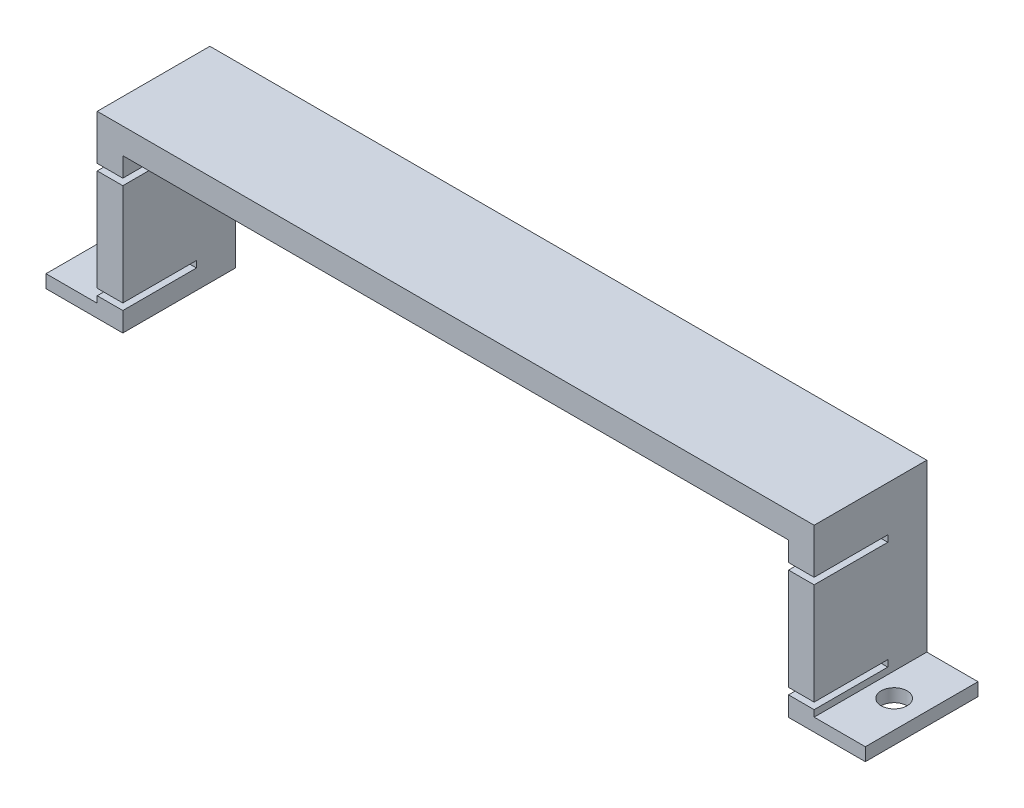
ISO-10303-21;
HEADER;
FILE_DESCRIPTION(('STEP AP214'),'2;1');
FILE_NAME('part.step','',(''),(''),'','','');
FILE_SCHEMA(('AUTOMOTIVE_DESIGN { 1 0 10303 214 1 1 1 1 }'));
ENDSEC;
DATA;
#1=APPLICATION_CONTEXT('core data for automotive mechanical design processes');
#2=APPLICATION_PROTOCOL_DEFINITION('international standard','automotive_design',2000,#1);
#3=PRODUCT_CONTEXT('',#1,'mechanical');
#4=PRODUCT('Part','Part','',(#3));
#5=PRODUCT_RELATED_PRODUCT_CATEGORY('part','',(#4));
#6=PRODUCT_DEFINITION_FORMATION('','',#4);
#7=PRODUCT_DEFINITION_CONTEXT('part definition',#1,'design');
#8=PRODUCT_DEFINITION('design','',#6,#7);
#9=PRODUCT_DEFINITION_SHAPE('','',#8);
#10=(LENGTH_UNIT() NAMED_UNIT(*) SI_UNIT(.MILLI.,.METRE.));
#11=(NAMED_UNIT(*) PLANE_ANGLE_UNIT() SI_UNIT($,.RADIAN.));
#12=(NAMED_UNIT(*) SI_UNIT($,.STERADIAN.) SOLID_ANGLE_UNIT());
#13=UNCERTAINTY_MEASURE_WITH_UNIT(LENGTH_MEASURE(1.E-05),#10,'distance_accuracy_value','');
#14=(GEOMETRIC_REPRESENTATION_CONTEXT(3) GLOBAL_UNCERTAINTY_ASSIGNED_CONTEXT((#13)) GLOBAL_UNIT_ASSIGNED_CONTEXT((#10,
#11,#12)) REPRESENTATION_CONTEXT('',''));
#15=CARTESIAN_POINT('',(0.,0.,0.));
#16=DIRECTION('',(0.,0.,1.));
#17=DIRECTION('',(1.,0.,0.));
#18=AXIS2_PLACEMENT_3D('',#15,#16,#17);
#19=CARTESIAN_POINT('',(0.,35.,0.));
#20=DIRECTION('',(0.,0.,-1.));
#21=DIRECTION('',(-1.,0.,0.));
#22=AXIS2_PLACEMENT_3D('',#19,#20,#21);
#23=PLANE('',#22);
#24=DIRECTION('',(0.,-1.,0.));
#25=VECTOR('',#24,1.);
#26=CARTESIAN_POINT('',(15.,0.,0.));
#27=LINE('',#26,#25);
#28=CARTESIAN_POINT('',(15.,3.81,0.));
#29=VERTEX_POINT('',#28);
#30=CARTESIAN_POINT('',(15.,0.,0.));
#31=VERTEX_POINT('',#30);
#32=EDGE_CURVE('E349',#29,#31,#27,.T.);
#33=ORIENTED_EDGE('',*,*,#32,.F.);
#34=DIRECTION('',(-1.,0.,0.));
#35=VECTOR('',#34,1.);
#36=CARTESIAN_POINT('',(160.,3.81000000000002,0.));
#37=LINE('',#36,#35);
#38=CARTESIAN_POINT('',(9.99999999999999,3.81,0.));
#39=VERTEX_POINT('',#38);
#40=EDGE_CURVE('E251',#29,#39,#37,.T.);
#41=ORIENTED_EDGE('',*,*,#40,.T.);
#42=DIRECTION('',(0.,1.,0.));
#43=VECTOR('',#42,1.);
#44=CARTESIAN_POINT('',(9.99999999999998,35.,0.));
#45=LINE('',#44,#43);
#46=CARTESIAN_POINT('',(9.99999999999999,2.54,0.));
#47=VERTEX_POINT('',#46);
#48=EDGE_CURVE('E335',#47,#39,#45,.T.);
#49=ORIENTED_EDGE('',*,*,#48,.F.);
#50=DIRECTION('',(1.,0.,0.));
#51=VECTOR('',#50,1.);
#52=CARTESIAN_POINT('',(0.,2.54,0.));
#53=LINE('',#52,#51);
#54=CARTESIAN_POINT('',(0.,2.54,0.));
#55=VERTEX_POINT('',#54);
#56=EDGE_CURVE('E339',#55,#47,#53,.T.);
#57=ORIENTED_EDGE('',*,*,#56,.F.);
#58=DIRECTION('',(0.,-1.,0.));
#59=VECTOR('',#58,1.);
#60=CARTESIAN_POINT('',(0.,35.,0.));
#61=LINE('',#60,#59);
#62=CARTESIAN_POINT('',(0.,0.,0.));
#63=VERTEX_POINT('',#62);
#64=EDGE_CURVE('E11',#55,#63,#61,.T.);
#65=ORIENTED_EDGE('',*,*,#64,.T.);
#66=DIRECTION('',(1.,0.,0.));
#67=VECTOR('',#66,1.);
#68=CARTESIAN_POINT('',(0.,0.,0.));
#69=LINE('',#68,#67);
#70=EDGE_CURVE('E415',#63,#31,#69,.T.);
#71=ORIENTED_EDGE('',*,*,#70,.T.);
#72=EDGE_LOOP('',(#33,#41,#49,#57,#65,#71));
#73=FACE_BOUND('',#72,.T.);
#74=ADVANCED_FACE('F37',(#73),#23,.F.);
#75=DIRECTION('',(0.,-1.,0.));
#76=VECTOR('',#75,1.);
#77=CARTESIAN_POINT('',(150.,35.,0.));
#78=LINE('',#77,#76);
#79=CARTESIAN_POINT('',(150.,3.81000000000002,0.));
#80=VERTEX_POINT('',#79);
#81=CARTESIAN_POINT('',(150.,2.54000000000002,0.));
#82=VERTEX_POINT('',#81);
#83=EDGE_CURVE('E330',#80,#82,#78,.T.);
#84=ORIENTED_EDGE('',*,*,#83,.F.);
#85=CARTESIAN_POINT('',(145.,3.81000000000001,0.));
#86=VERTEX_POINT('',#85);
#87=EDGE_CURVE('E254',#80,#86,#37,.T.);
#88=ORIENTED_EDGE('',*,*,#87,.T.);
#89=DIRECTION('',(0.,1.,0.));
#90=VECTOR('',#89,1.);
#91=CARTESIAN_POINT('',(145.,0.,0.));
#92=LINE('',#91,#90);
#93=CARTESIAN_POINT('',(145.,0.,0.));
#94=VERTEX_POINT('',#93);
#95=EDGE_CURVE('E388',#94,#86,#92,.T.);
#96=ORIENTED_EDGE('',*,*,#95,.F.);
#97=CARTESIAN_POINT('',(160.,0.,0.));
#98=VERTEX_POINT('',#97);
#99=EDGE_CURVE('E414',#94,#98,#69,.T.);
#100=ORIENTED_EDGE('',*,*,#99,.T.);
#101=DIRECTION('',(0.,-1.,0.));
#102=VECTOR('',#101,1.);
#103=CARTESIAN_POINT('',(160.,35.,0.));
#104=LINE('',#103,#102);
#105=CARTESIAN_POINT('',(160.,2.54000000000002,0.));
#106=VERTEX_POINT('',#105);
#107=EDGE_CURVE('E45',#106,#98,#104,.T.);
#108=ORIENTED_EDGE('',*,*,#107,.F.);
#109=DIRECTION('',(1.,0.,0.));
#110=VECTOR('',#109,1.);
#111=CARTESIAN_POINT('',(160.,2.54000000000002,0.));
#112=LINE('',#111,#110);
#113=EDGE_CURVE('E357',#82,#106,#112,.T.);
#114=ORIENTED_EDGE('',*,*,#113,.F.);
#115=EDGE_LOOP('',(#84,#88,#96,#100,#108,#114));
#116=FACE_BOUND('',#115,.T.);
#117=ADVANCED_FACE('F438',(#116),#23,.F.);
#118=CARTESIAN_POINT('',(9.99999999999998,26.19,0.));
#119=VERTEX_POINT('',#118);
#120=CARTESIAN_POINT('',(9.99999999999999,35.,0.));
#121=VERTEX_POINT('',#120);
#122=EDGE_CURVE('E342',#119,#121,#45,.T.);
#123=ORIENTED_EDGE('',*,*,#122,.F.);
#124=DIRECTION('',(-1.,0.,0.));
#125=VECTOR('',#124,1.);
#126=CARTESIAN_POINT('',(160.,26.19,0.));
#127=LINE('',#126,#125);
#128=CARTESIAN_POINT('',(15.,26.19,0.));
#129=VERTEX_POINT('',#128);
#130=EDGE_CURVE('E268',#129,#119,#127,.T.);
#131=ORIENTED_EDGE('',*,*,#130,.F.);
#132=CARTESIAN_POINT('',(15.,30.,0.));
#133=VERTEX_POINT('',#132);
#134=EDGE_CURVE('E383',#133,#129,#27,.T.);
#135=ORIENTED_EDGE('',*,*,#134,.F.);
#136=DIRECTION('',(-1.,0.,0.));
#137=VECTOR('',#136,1.);
#138=CARTESIAN_POINT('',(15.,30.,0.));
#139=LINE('',#138,#137);
#140=CARTESIAN_POINT('',(145.,30.,0.));
#141=VERTEX_POINT('',#140);
#142=EDGE_CURVE('E376',#141,#133,#139,.T.);
#143=ORIENTED_EDGE('',*,*,#142,.F.);
#144=CARTESIAN_POINT('',(145.,26.19,0.));
#145=VERTEX_POINT('',#144);
#146=EDGE_CURVE('E386',#145,#141,#92,.T.);
#147=ORIENTED_EDGE('',*,*,#146,.F.);
#148=CARTESIAN_POINT('',(150.,26.19,0.));
#149=VERTEX_POINT('',#148);
#150=EDGE_CURVE('E242',#149,#145,#127,.T.);
#151=ORIENTED_EDGE('',*,*,#150,.F.);
#152=CARTESIAN_POINT('',(150.,35.,0.));
#153=VERTEX_POINT('',#152);
#154=EDGE_CURVE('E361',#153,#149,#78,.T.);
#155=ORIENTED_EDGE('',*,*,#154,.F.);
#156=DIRECTION('',(1.,0.,0.));
#157=VECTOR('',#156,1.);
#158=CARTESIAN_POINT('',(0.,35.,0.));
#159=LINE('',#158,#157);
#160=EDGE_CURVE('E404',#121,#153,#159,.T.);
#161=ORIENTED_EDGE('',*,*,#160,.F.);
#162=EDGE_LOOP('',(#123,#131,#135,#143,#147,#151,#155,#161));
#163=FACE_BOUND('',#162,.T.);
#164=ADVANCED_FACE('F490',(#163),#23,.F.);
#165=CARTESIAN_POINT('',(145.,5.08000000000001,0.));
#166=VERTEX_POINT('',#165);
#167=CARTESIAN_POINT('',(145.,24.92,0.));
#168=VERTEX_POINT('',#167);
#169=EDGE_CURVE('E391',#166,#168,#92,.T.);
#170=ORIENTED_EDGE('',*,*,#169,.F.);
#171=DIRECTION('',(-1.,0.,0.));
#172=VECTOR('',#171,1.);
#173=CARTESIAN_POINT('',(160.,5.08000000000002,0.));
#174=LINE('',#173,#172);
#175=CARTESIAN_POINT('',(150.,5.08000000000002,0.));
#176=VERTEX_POINT('',#175);
#177=EDGE_CURVE('E232',#176,#166,#174,.T.);
#178=ORIENTED_EDGE('',*,*,#177,.F.);
#179=CARTESIAN_POINT('',(150.,24.92,0.));
#180=VERTEX_POINT('',#179);
#181=EDGE_CURVE('E364',#180,#176,#78,.T.);
#182=ORIENTED_EDGE('',*,*,#181,.F.);
#183=DIRECTION('',(-1.,0.,0.));
#184=VECTOR('',#183,1.);
#185=CARTESIAN_POINT('',(160.,24.92,0.));
#186=LINE('',#185,#184);
#187=EDGE_CURVE('E270',#180,#168,#186,.T.);
#188=ORIENTED_EDGE('',*,*,#187,.T.);
#189=EDGE_LOOP('',(#170,#178,#182,#188));
#190=FACE_BOUND('',#189,.T.);
#191=ADVANCED_FACE('F457',(#190),#23,.F.);
#192=CARTESIAN_POINT('',(0.,0.,0.));
#193=DIRECTION('',(0.,-1.,0.));
#194=DIRECTION('',(0.,0.,-1.));
#195=AXIS2_PLACEMENT_3D('',#192,#193,#194);
#196=PLANE('',#195);
#197=CARTESIAN_POINT('',(5.,0.,-11.));
#198=DIRECTION('',(0.,1.,0.));
#199=DIRECTION('',(-1.,0.,0.));
#200=AXIS2_PLACEMENT_3D('',#197,#198,#199);
#201=CIRCLE('',#200,2.54);
#202=CARTESIAN_POINT('',(2.46,0.,-11.));
#203=VERTEX_POINT('',#202);
#204=EDGE_CURVE('E758',#203,#203,#201,.T.);
#205=ORIENTED_EDGE('',*,*,#204,.T.);
#206=EDGE_LOOP('',(#205));
#207=FACE_BOUND('',#206,.T.);
#208=DIRECTION('',(0.,0.,1.));
#209=VECTOR('',#208,1.);
#210=CARTESIAN_POINT('',(15.,0.,-22.));
#211=LINE('',#210,#209);
#212=CARTESIAN_POINT('',(15.,0.,-22.));
#213=VERTEX_POINT('',#212);
#214=EDGE_CURVE('E382',#213,#31,#211,.T.);
#215=ORIENTED_EDGE('',*,*,#214,.T.);
#216=ORIENTED_EDGE('',*,*,#70,.F.);
#217=DIRECTION('',(0.,0.,1.));
#218=VECTOR('',#217,1.);
#219=CARTESIAN_POINT('',(0.,0.,0.));
#220=LINE('',#219,#218);
#221=CARTESIAN_POINT('',(0.,0.,-22.));
#222=VERTEX_POINT('',#221);
#223=EDGE_CURVE('E396',#222,#63,#220,.T.);
#224=ORIENTED_EDGE('',*,*,#223,.F.);
#225=DIRECTION('',(-1.,0.,0.));
#226=VECTOR('',#225,1.);
#227=CARTESIAN_POINT('',(0.,0.,-22.));
#228=LINE('',#227,#226);
#229=EDGE_CURVE('E421',#213,#222,#228,.T.);
#230=ORIENTED_EDGE('',*,*,#229,.F.);
#231=EDGE_LOOP('',(#215,#216,#224,#230));
#232=FACE_BOUND('',#231,.T.);
#233=ADVANCED_FACE('F499',(#207,#232),#196,.T.);
#234=CARTESIAN_POINT('',(0.,35.,0.));
#235=DIRECTION('',(1.,0.,0.));
#236=DIRECTION('',(0.,0.,-1.));
#237=AXIS2_PLACEMENT_3D('',#234,#235,#236);
#238=PLANE('',#237);
#239=ORIENTED_EDGE('',*,*,#64,.F.);
#240=DIRECTION('',(0.,0.,1.));
#241=VECTOR('',#240,1.);
#242=CARTESIAN_POINT('',(0.,2.54,-22.));
#243=LINE('',#242,#241);
#244=CARTESIAN_POINT('',(0.,2.54,-22.));
#245=VERTEX_POINT('',#244);
#246=EDGE_CURVE('E338',#245,#55,#243,.T.);
#247=ORIENTED_EDGE('',*,*,#246,.F.);
#248=DIRECTION('',(0.,-1.,0.));
#249=VECTOR('',#248,1.);
#250=CARTESIAN_POINT('',(0.,35.,-22.));
#251=LINE('',#250,#249);
#252=EDGE_CURVE('E411',#245,#222,#251,.T.);
#253=ORIENTED_EDGE('',*,*,#252,.T.);
#254=ORIENTED_EDGE('',*,*,#223,.T.);
#255=EDGE_LOOP('',(#239,#247,#253,#254));
#256=FACE_BOUND('',#255,.T.);
#257=ADVANCED_FACE('F39',(#256),#238,.F.);
#258=CARTESIAN_POINT('',(9.99999999999999,5.07999999999999,0.));
#259=VERTEX_POINT('',#258);
#260=CARTESIAN_POINT('',(9.99999999999998,24.92,0.));
#261=VERTEX_POINT('',#260);
#262=EDGE_CURVE('E345',#259,#261,#45,.T.);
#263=ORIENTED_EDGE('',*,*,#262,.F.);
#264=CARTESIAN_POINT('',(15.,5.08,0.));
#265=VERTEX_POINT('',#264);
#266=EDGE_CURVE('E238',#265,#259,#174,.T.);
#267=ORIENTED_EDGE('',*,*,#266,.F.);
#268=CARTESIAN_POINT('',(15.,24.92,0.));
#269=VERTEX_POINT('',#268);
#270=EDGE_CURVE('E387',#269,#265,#27,.T.);
#271=ORIENTED_EDGE('',*,*,#270,.F.);
#272=EDGE_CURVE('E271',#269,#261,#186,.T.);
#273=ORIENTED_EDGE('',*,*,#272,.T.);
#274=EDGE_LOOP('',(#263,#267,#271,#273));
#275=FACE_BOUND('',#274,.T.);
#276=ADVANCED_FACE('F486',(#275),#23,.F.);
#277=CARTESIAN_POINT('',(160.,35.,0.));
#278=DIRECTION('',(-1.,0.,0.));
#279=DIRECTION('',(0.,0.,1.));
#280=AXIS2_PLACEMENT_3D('',#277,#278,#279);
#281=PLANE('',#280);
#282=DIRECTION('',(0.,-1.,0.));
#283=VECTOR('',#282,1.);
#284=CARTESIAN_POINT('',(160.,35.,-22.));
#285=LINE('',#284,#283);
#286=CARTESIAN_POINT('',(160.,2.54000000000002,-22.));
#287=VERTEX_POINT('',#286);
#288=CARTESIAN_POINT('',(160.,0.,-22.));
#289=VERTEX_POINT('',#288);
#290=EDGE_CURVE('E425',#287,#289,#285,.T.);
#291=ORIENTED_EDGE('',*,*,#290,.F.);
#292=DIRECTION('',(0.,0.,1.));
#293=VECTOR('',#292,1.);
#294=CARTESIAN_POINT('',(160.,2.54000000000002,-22.));
#295=LINE('',#294,#293);
#296=EDGE_CURVE('E343',#287,#106,#295,.T.);
#297=ORIENTED_EDGE('',*,*,#296,.T.);
#298=ORIENTED_EDGE('',*,*,#107,.T.);
#299=DIRECTION('',(0.,0.,-1.));
#300=VECTOR('',#299,1.);
#301=CARTESIAN_POINT('',(160.,0.,0.));
#302=LINE('',#301,#300);
#303=EDGE_CURVE('E418',#98,#289,#302,.T.);
#304=ORIENTED_EDGE('',*,*,#303,.T.);
#305=EDGE_LOOP('',(#291,#297,#298,#304));
#306=FACE_BOUND('',#305,.T.);
#307=ADVANCED_FACE('F430',(#306),#281,.F.);
#308=CARTESIAN_POINT('',(0.,35.,-22.));
#309=DIRECTION('',(0.,0.,1.));
#310=DIRECTION('',(1.,0.,0.));
#311=AXIS2_PLACEMENT_3D('',#308,#309,#310);
#312=PLANE('',#311);
#313=DIRECTION('',(1.,0.,0.));
#314=VECTOR('',#313,1.);
#315=CARTESIAN_POINT('',(0.,2.54,-22.));
#316=LINE('',#315,#314);
#317=CARTESIAN_POINT('',(9.99999999999999,2.54,-22.));
#318=VERTEX_POINT('',#317);
#319=EDGE_CURVE('E331',#245,#318,#316,.T.);
#320=ORIENTED_EDGE('',*,*,#319,.T.);
#321=DIRECTION('',(0.,1.,0.));
#322=VECTOR('',#321,1.);
#323=CARTESIAN_POINT('',(9.99999999999998,35.,-22.));
#324=LINE('',#323,#322);
#325=CARTESIAN_POINT('',(9.99999999999998,35.,-22.));
#326=VERTEX_POINT('',#325);
#327=EDGE_CURVE('E334',#318,#326,#324,.T.);
#328=ORIENTED_EDGE('',*,*,#327,.T.);
#329=DIRECTION('',(-1.,0.,0.));
#330=VECTOR('',#329,1.);
#331=CARTESIAN_POINT('',(0.,35.,-22.));
#332=LINE('',#331,#330);
#333=CARTESIAN_POINT('',(150.,35.,-22.));
#334=VERTEX_POINT('',#333);
#335=EDGE_CURVE('E407',#334,#326,#332,.T.);
#336=ORIENTED_EDGE('',*,*,#335,.F.);
#337=DIRECTION('',(0.,-1.,0.));
#338=VECTOR('',#337,1.);
#339=CARTESIAN_POINT('',(150.,35.,-22.));
#340=LINE('',#339,#338);
#341=CARTESIAN_POINT('',(150.,2.54000000000002,-22.));
#342=VERTEX_POINT('',#341);
#343=EDGE_CURVE('E353',#334,#342,#340,.T.);
#344=ORIENTED_EDGE('',*,*,#343,.T.);
#345=DIRECTION('',(1.,0.,0.));
#346=VECTOR('',#345,1.);
#347=CARTESIAN_POINT('',(160.,2.54000000000002,-22.));
#348=LINE('',#347,#346);
#349=EDGE_CURVE('E356',#342,#287,#348,.T.);
#350=ORIENTED_EDGE('',*,*,#349,.T.);
#351=ORIENTED_EDGE('',*,*,#290,.T.);
#352=CARTESIAN_POINT('',(145.,0.,-22.));
#353=VERTEX_POINT('',#352);
#354=EDGE_CURVE('E408',#289,#353,#228,.T.);
#355=ORIENTED_EDGE('',*,*,#354,.T.);
#356=DIRECTION('',(0.,1.,0.));
#357=VECTOR('',#356,1.);
#358=CARTESIAN_POINT('',(145.,0.,-22.));
#359=LINE('',#358,#357);
#360=CARTESIAN_POINT('',(145.,30.,-22.));
#361=VERTEX_POINT('',#360);
#362=EDGE_CURVE('E375',#353,#361,#359,.T.);
#363=ORIENTED_EDGE('',*,*,#362,.T.);
#364=DIRECTION('',(-1.,0.,0.));
#365=VECTOR('',#364,1.);
#366=CARTESIAN_POINT('',(15.,30.,-22.));
#367=LINE('',#366,#365);
#368=CARTESIAN_POINT('',(15.,30.,-22.));
#369=VERTEX_POINT('',#368);
#370=EDGE_CURVE('E379',#361,#369,#367,.T.);
#371=ORIENTED_EDGE('',*,*,#370,.T.);
#372=DIRECTION('',(0.,-1.,0.));
#373=VECTOR('',#372,1.);
#374=CARTESIAN_POINT('',(15.,0.,-22.));
#375=LINE('',#374,#373);
#376=EDGE_CURVE('E372',#369,#213,#375,.T.);
#377=ORIENTED_EDGE('',*,*,#376,.T.);
#378=ORIENTED_EDGE('',*,*,#229,.T.);
#379=ORIENTED_EDGE('',*,*,#252,.F.);
#380=EDGE_LOOP('',(#320,#328,#336,#344,#350,#351,#355,#363,#371,#377,#378,#379));
#381=FACE_BOUND('',#380,.T.);
#382=ADVANCED_FACE('F444',(#381),#312,.F.);
#383=CARTESIAN_POINT('',(0.,35.,0.));
#384=DIRECTION('',(0.,-1.,0.));
#385=DIRECTION('',(0.,0.,-1.));
#386=AXIS2_PLACEMENT_3D('',#383,#384,#385);
#387=PLANE('',#386);
#388=ORIENTED_EDGE('',*,*,#335,.T.);
#389=DIRECTION('',(0.,0.,1.));
#390=VECTOR('',#389,1.);
#391=CARTESIAN_POINT('',(9.99999999999998,35.,-22.));
#392=LINE('',#391,#390);
#393=EDGE_CURVE('E346',#326,#121,#392,.T.);
#394=ORIENTED_EDGE('',*,*,#393,.T.);
#395=ORIENTED_EDGE('',*,*,#160,.T.);
#396=DIRECTION('',(0.,0.,1.));
#397=VECTOR('',#396,1.);
#398=CARTESIAN_POINT('',(150.,35.,-22.));
#399=LINE('',#398,#397);
#400=EDGE_CURVE('E360',#334,#153,#399,.T.);
#401=ORIENTED_EDGE('',*,*,#400,.F.);
#402=EDGE_LOOP('',(#388,#394,#395,#401));
#403=FACE_BOUND('',#402,.T.);
#404=ADVANCED_FACE('F551',(#403),#387,.F.);
#405=CARTESIAN_POINT('',(154.621372276424,0.,-11.));
#406=DIRECTION('',(0.,1.,0.));
#407=DIRECTION('',(-1.,0.,0.));
#408=AXIS2_PLACEMENT_3D('',#405,#406,#407);
#409=CIRCLE('',#408,2.53999999999998);
#410=CARTESIAN_POINT('',(152.081372276424,0.,-11.));
#411=VERTEX_POINT('',#410);
#412=EDGE_CURVE('E262',#411,#411,#409,.T.);
#413=ORIENTED_EDGE('',*,*,#412,.T.);
#414=EDGE_LOOP('',(#413));
#415=FACE_BOUND('',#414,.T.);
#416=DIRECTION('',(0.,0.,1.));
#417=VECTOR('',#416,1.);
#418=CARTESIAN_POINT('',(145.,0.,-22.));
#419=LINE('',#418,#417);
#420=EDGE_CURVE('E400',#353,#94,#419,.T.);
#421=ORIENTED_EDGE('',*,*,#420,.F.);
#422=ORIENTED_EDGE('',*,*,#354,.F.);
#423=ORIENTED_EDGE('',*,*,#303,.F.);
#424=ORIENTED_EDGE('',*,*,#99,.F.);
#425=EDGE_LOOP('',(#421,#422,#423,#424));
#426=FACE_BOUND('',#425,.T.);
#427=ADVANCED_FACE('F442',(#415,#426),#196,.T.);
#428=CARTESIAN_POINT('',(15.,0.,-22.));
#429=DIRECTION('',(-1.,0.,0.));
#430=DIRECTION('',(0.,0.,1.));
#431=AXIS2_PLACEMENT_3D('',#428,#429,#430);
#432=PLANE('',#431);
#433=DIRECTION('',(0.,-1.,0.));
#434=VECTOR('',#433,1.);
#435=CARTESIAN_POINT('',(15.,0.,-14.38));
#436=LINE('',#435,#434);
#437=CARTESIAN_POINT('',(15.,5.08,-14.38));
#438=VERTEX_POINT('',#437);
#439=CARTESIAN_POINT('',(15.,3.81,-14.38));
#440=VERTEX_POINT('',#439);
#441=EDGE_CURVE('E229',#438,#440,#436,.T.);
#442=ORIENTED_EDGE('',*,*,#441,.T.);
#443=DIRECTION('',(0.,0.,1.));
#444=VECTOR('',#443,1.);
#445=CARTESIAN_POINT('',(15.,3.81,-22.));
#446=LINE('',#445,#444);
#447=EDGE_CURVE('E327',#440,#29,#446,.T.);
#448=ORIENTED_EDGE('',*,*,#447,.T.);
#449=ORIENTED_EDGE('',*,*,#32,.T.);
#450=ORIENTED_EDGE('',*,*,#214,.F.);
#451=ORIENTED_EDGE('',*,*,#376,.F.);
#452=DIRECTION('',(0.,0.,1.));
#453=VECTOR('',#452,1.);
#454=CARTESIAN_POINT('',(15.,30.,-22.));
#455=LINE('',#454,#453);
#456=EDGE_CURVE('E394',#369,#133,#455,.T.);
#457=ORIENTED_EDGE('',*,*,#456,.T.);
#458=ORIENTED_EDGE('',*,*,#134,.T.);
#459=DIRECTION('',(0.,0.,-1.));
#460=VECTOR('',#459,1.);
#461=CARTESIAN_POINT('',(15.,26.19,-22.));
#462=LINE('',#461,#460);
#463=CARTESIAN_POINT('',(15.,26.19,-14.38));
#464=VERTEX_POINT('',#463);
#465=EDGE_CURVE('E303',#129,#464,#462,.T.);
#466=ORIENTED_EDGE('',*,*,#465,.T.);
#467=DIRECTION('',(0.,-1.,0.));
#468=VECTOR('',#467,1.);
#469=CARTESIAN_POINT('',(15.,0.,-14.38));
#470=LINE('',#469,#468);
#471=CARTESIAN_POINT('',(15.,24.92,-14.38));
#472=VERTEX_POINT('',#471);
#473=EDGE_CURVE('E285',#464,#472,#470,.T.);
#474=ORIENTED_EDGE('',*,*,#473,.T.);
#475=DIRECTION('',(0.,0.,1.));
#476=VECTOR('',#475,1.);
#477=CARTESIAN_POINT('',(15.,24.92,-22.));
#478=LINE('',#477,#476);
#479=EDGE_CURVE('E294',#472,#269,#478,.T.);
#480=ORIENTED_EDGE('',*,*,#479,.T.);
#481=ORIENTED_EDGE('',*,*,#270,.T.);
#482=DIRECTION('',(0.,0.,-1.));
#483=VECTOR('',#482,1.);
#484=CARTESIAN_POINT('',(15.,5.08,-22.));
#485=LINE('',#484,#483);
#486=EDGE_CURVE('E312',#265,#438,#485,.T.);
#487=ORIENTED_EDGE('',*,*,#486,.T.);
#488=EDGE_LOOP('',(#442,#448,#449,#450,#451,#457,#458,#466,#474,#480,#481,#487));
#489=FACE_BOUND('',#488,.T.);
#490=ADVANCED_FACE('F525',(#489),#432,.F.);
#491=CARTESIAN_POINT('',(15.,30.,-22.));
#492=DIRECTION('',(0.,1.,0.));
#493=DIRECTION('',(-1.,0.,0.));
#494=AXIS2_PLACEMENT_3D('',#491,#492,#493);
#495=PLANE('',#494);
#496=ORIENTED_EDGE('',*,*,#142,.T.);
#497=ORIENTED_EDGE('',*,*,#456,.F.);
#498=ORIENTED_EDGE('',*,*,#370,.F.);
#499=DIRECTION('',(0.,0.,1.));
#500=VECTOR('',#499,1.);
#501=CARTESIAN_POINT('',(145.,30.,-22.));
#502=LINE('',#501,#500);
#503=EDGE_CURVE('E397',#361,#141,#502,.T.);
#504=ORIENTED_EDGE('',*,*,#503,.T.);
#505=EDGE_LOOP('',(#496,#497,#498,#504));
#506=FACE_BOUND('',#505,.T.);
#507=ADVANCED_FACE('F568',(#506),#495,.F.);
#508=CARTESIAN_POINT('',(145.,0.,-22.));
#509=DIRECTION('',(1.,0.,0.));
#510=DIRECTION('',(0.,0.,-1.));
#511=AXIS2_PLACEMENT_3D('',#508,#509,#510);
#512=PLANE('',#511);
#513=ORIENTED_EDGE('',*,*,#95,.T.);
#514=DIRECTION('',(0.,0.,-1.));
#515=VECTOR('',#514,1.);
#516=CARTESIAN_POINT('',(145.,3.81000000000001,-22.));
#517=LINE('',#516,#515);
#518=CARTESIAN_POINT('',(145.,3.81000000000001,-14.38));
#519=VERTEX_POINT('',#518);
#520=EDGE_CURVE('E324',#86,#519,#517,.T.);
#521=ORIENTED_EDGE('',*,*,#520,.T.);
#522=DIRECTION('',(0.,1.,0.));
#523=VECTOR('',#522,1.);
#524=CARTESIAN_POINT('',(145.,0.,-14.38));
#525=LINE('',#524,#523);
#526=CARTESIAN_POINT('',(145.,5.08000000000001,-14.38));
#527=VERTEX_POINT('',#526);
#528=EDGE_CURVE('E317',#519,#527,#525,.T.);
#529=ORIENTED_EDGE('',*,*,#528,.T.);
#530=DIRECTION('',(0.,0.,1.));
#531=VECTOR('',#530,1.);
#532=CARTESIAN_POINT('',(145.,5.08000000000001,-22.));
#533=LINE('',#532,#531);
#534=EDGE_CURVE('E309',#527,#166,#533,.T.);
#535=ORIENTED_EDGE('',*,*,#534,.T.);
#536=ORIENTED_EDGE('',*,*,#169,.T.);
#537=DIRECTION('',(0.,0.,-1.));
#538=VECTOR('',#537,1.);
#539=CARTESIAN_POINT('',(145.,24.92,-22.));
#540=LINE('',#539,#538);
#541=CARTESIAN_POINT('',(145.,24.92,-14.38));
#542=VERTEX_POINT('',#541);
#543=EDGE_CURVE('E291',#168,#542,#540,.T.);
#544=ORIENTED_EDGE('',*,*,#543,.T.);
#545=DIRECTION('',(0.,1.,0.));
#546=VECTOR('',#545,1.);
#547=CARTESIAN_POINT('',(145.,0.,-14.38));
#548=LINE('',#547,#546);
#549=CARTESIAN_POINT('',(145.,26.19,-14.38));
#550=VERTEX_POINT('',#549);
#551=EDGE_CURVE('E282',#542,#550,#548,.T.);
#552=ORIENTED_EDGE('',*,*,#551,.T.);
#553=DIRECTION('',(0.,0.,1.));
#554=VECTOR('',#553,1.);
#555=CARTESIAN_POINT('',(145.,26.19,-22.));
#556=LINE('',#555,#554);
#557=EDGE_CURVE('E300',#550,#145,#556,.T.);
#558=ORIENTED_EDGE('',*,*,#557,.T.);
#559=ORIENTED_EDGE('',*,*,#146,.T.);
#560=ORIENTED_EDGE('',*,*,#503,.F.);
#561=ORIENTED_EDGE('',*,*,#362,.F.);
#562=ORIENTED_EDGE('',*,*,#420,.T.);
#563=EDGE_LOOP('',(#513,#521,#529,#535,#536,#544,#552,#558,#559,#560,#561,#562));
#564=FACE_BOUND('',#563,.T.);
#565=ADVANCED_FACE('F461',(#564),#512,.F.);
#566=CARTESIAN_POINT('',(160.,2.54000000000002,-22.));
#567=DIRECTION('',(0.,-1.,0.));
#568=DIRECTION('',(1.,0.,0.));
#569=AXIS2_PLACEMENT_3D('',#566,#567,#568);
#570=PLANE('',#569);
#571=CARTESIAN_POINT('',(154.621372276424,2.54000000000002,-11.));
#572=DIRECTION('',(0.,1.,0.));
#573=DIRECTION('',(-1.,0.,0.));
#574=AXIS2_PLACEMENT_3D('',#571,#572,#573);
#575=CIRCLE('',#574,2.53999999999998);
#576=CARTESIAN_POINT('',(152.081372276424,2.54000000000002,-11.));
#577=VERTEX_POINT('',#576);
#578=EDGE_CURVE('E756',#577,#577,#575,.T.);
#579=ORIENTED_EDGE('',*,*,#578,.F.);
#580=EDGE_LOOP('',(#579));
#581=FACE_BOUND('',#580,.T.);
#582=ORIENTED_EDGE('',*,*,#113,.T.);
#583=ORIENTED_EDGE('',*,*,#296,.F.);
#584=ORIENTED_EDGE('',*,*,#349,.F.);
#585=DIRECTION('',(0.,0.,1.));
#586=VECTOR('',#585,1.);
#587=CARTESIAN_POINT('',(150.,2.54000000000002,-22.));
#588=LINE('',#587,#586);
#589=EDGE_CURVE('E368',#342,#82,#588,.T.);
#590=ORIENTED_EDGE('',*,*,#589,.T.);
#591=EDGE_LOOP('',(#582,#583,#584,#590));
#592=FACE_BOUND('',#591,.T.);
#593=ADVANCED_FACE('F448',(#581,#592),#570,.F.);
#594=CARTESIAN_POINT('',(150.,35.,-22.));
#595=DIRECTION('',(-1.,0.,0.));
#596=DIRECTION('',(0.,-1.,0.));
#597=AXIS2_PLACEMENT_3D('',#594,#595,#596);
#598=PLANE('',#597);
#599=DIRECTION('',(0.,-1.,0.));
#600=VECTOR('',#599,1.);
#601=CARTESIAN_POINT('',(150.,35.,-14.38));
#602=LINE('',#601,#600);
#603=CARTESIAN_POINT('',(150.,5.08000000000001,-14.38));
#604=VERTEX_POINT('',#603);
#605=CARTESIAN_POINT('',(150.,3.81000000000001,-14.38));
#606=VERTEX_POINT('',#605);
#607=EDGE_CURVE('E314',#604,#606,#602,.T.);
#608=ORIENTED_EDGE('',*,*,#607,.T.);
#609=DIRECTION('',(0.,0.,1.));
#610=VECTOR('',#609,1.);
#611=CARTESIAN_POINT('',(150.,3.81000000000001,-22.));
#612=LINE('',#611,#610);
#613=EDGE_CURVE('E321',#606,#80,#612,.T.);
#614=ORIENTED_EDGE('',*,*,#613,.T.);
#615=ORIENTED_EDGE('',*,*,#83,.T.);
#616=ORIENTED_EDGE('',*,*,#589,.F.);
#617=ORIENTED_EDGE('',*,*,#343,.F.);
#618=ORIENTED_EDGE('',*,*,#400,.T.);
#619=ORIENTED_EDGE('',*,*,#154,.T.);
#620=DIRECTION('',(0.,0.,-1.));
#621=VECTOR('',#620,1.);
#622=CARTESIAN_POINT('',(150.,26.19,-22.));
#623=LINE('',#622,#621);
#624=CARTESIAN_POINT('',(150.,26.19,-14.38));
#625=VERTEX_POINT('',#624);
#626=EDGE_CURVE('E297',#149,#625,#623,.T.);
#627=ORIENTED_EDGE('',*,*,#626,.T.);
#628=DIRECTION('',(0.,-1.,0.));
#629=VECTOR('',#628,1.);
#630=CARTESIAN_POINT('',(150.,35.,-14.38));
#631=LINE('',#630,#629);
#632=CARTESIAN_POINT('',(150.,24.92,-14.38));
#633=VERTEX_POINT('',#632);
#634=EDGE_CURVE('E279',#625,#633,#631,.T.);
#635=ORIENTED_EDGE('',*,*,#634,.T.);
#636=DIRECTION('',(0.,0.,1.));
#637=VECTOR('',#636,1.);
#638=CARTESIAN_POINT('',(150.,24.92,-22.));
#639=LINE('',#638,#637);
#640=EDGE_CURVE('E288',#633,#180,#639,.T.);
#641=ORIENTED_EDGE('',*,*,#640,.T.);
#642=ORIENTED_EDGE('',*,*,#181,.T.);
#643=DIRECTION('',(0.,0.,-1.));
#644=VECTOR('',#643,1.);
#645=CARTESIAN_POINT('',(150.,5.08000000000001,-22.));
#646=LINE('',#645,#644);
#647=EDGE_CURVE('E306',#176,#604,#646,.T.);
#648=ORIENTED_EDGE('',*,*,#647,.T.);
#649=EDGE_LOOP('',(#608,#614,#615,#616,#617,#618,#619,#627,#635,#641,#642,#648));
#650=FACE_BOUND('',#649,.T.);
#651=ADVANCED_FACE('F452',(#650),#598,.F.);
#652=CARTESIAN_POINT('',(9.99999999999998,35.,-22.));
#653=DIRECTION('',(1.,0.,0.));
#654=DIRECTION('',(0.,1.,0.));
#655=AXIS2_PLACEMENT_3D('',#652,#653,#654);
#656=PLANE('',#655);
#657=ORIENTED_EDGE('',*,*,#48,.T.);
#658=DIRECTION('',(0.,0.,1.));
#659=VECTOR('',#658,1.);
#660=CARTESIAN_POINT('',(9.99999999999999,3.81,0.));
#661=LINE('',#660,#659);
#662=CARTESIAN_POINT('',(9.99999999999999,3.81,-14.38));
#663=VERTEX_POINT('',#662);
#664=EDGE_CURVE('E246',#663,#39,#661,.T.);
#665=ORIENTED_EDGE('',*,*,#664,.F.);
#666=DIRECTION('',(0.,-1.,0.));
#667=VECTOR('',#666,1.);
#668=CARTESIAN_POINT('',(9.99999999999999,3.81,-14.38));
#669=LINE('',#668,#667);
#670=CARTESIAN_POINT('',(9.99999999999999,5.08,-14.38));
#671=VERTEX_POINT('',#670);
#672=EDGE_CURVE('E226',#671,#663,#669,.T.);
#673=ORIENTED_EDGE('',*,*,#672,.F.);
#674=DIRECTION('',(0.,0.,-1.));
#675=VECTOR('',#674,1.);
#676=CARTESIAN_POINT('',(9.99999999999999,5.08,0.));
#677=LINE('',#676,#675);
#678=EDGE_CURVE('E235',#259,#671,#677,.T.);
#679=ORIENTED_EDGE('',*,*,#678,.F.);
#680=ORIENTED_EDGE('',*,*,#262,.T.);
#681=DIRECTION('',(0.,0.,1.));
#682=VECTOR('',#681,1.);
#683=CARTESIAN_POINT('',(9.99999999999998,24.92,0.));
#684=LINE('',#683,#682);
#685=CARTESIAN_POINT('',(9.99999999999998,24.92,-14.38));
#686=VERTEX_POINT('',#685);
#687=EDGE_CURVE('E265',#686,#261,#684,.T.);
#688=ORIENTED_EDGE('',*,*,#687,.F.);
#689=DIRECTION('',(0.,-1.,0.));
#690=VECTOR('',#689,1.);
#691=CARTESIAN_POINT('',(9.99999999999998,26.19,-14.38));
#692=LINE('',#691,#690);
#693=CARTESIAN_POINT('',(9.99999999999999,26.19,-14.38));
#694=VERTEX_POINT('',#693);
#695=EDGE_CURVE('E261',#694,#686,#692,.T.);
#696=ORIENTED_EDGE('',*,*,#695,.F.);
#697=DIRECTION('',(0.,0.,-1.));
#698=VECTOR('',#697,1.);
#699=CARTESIAN_POINT('',(9.99999999999998,26.19,0.));
#700=LINE('',#699,#698);
#701=EDGE_CURVE('E259',#119,#694,#700,.T.);
#702=ORIENTED_EDGE('',*,*,#701,.F.);
#703=ORIENTED_EDGE('',*,*,#122,.T.);
#704=ORIENTED_EDGE('',*,*,#393,.F.);
#705=ORIENTED_EDGE('',*,*,#327,.F.);
#706=DIRECTION('',(0.,0.,1.));
#707=VECTOR('',#706,1.);
#708=CARTESIAN_POINT('',(9.99999999999999,2.54,-22.));
#709=LINE('',#708,#707);
#710=EDGE_CURVE('E350',#318,#47,#709,.T.);
#711=ORIENTED_EDGE('',*,*,#710,.T.);
#712=EDGE_LOOP('',(#657,#665,#673,#679,#680,#688,#696,#702,#703,#704,#705,#711));
#713=FACE_BOUND('',#712,.T.);
#714=ADVANCED_FACE('F245',(#713),#656,.F.);
#715=CARTESIAN_POINT('',(0.,2.54,-22.));
#716=DIRECTION('',(0.,-1.,0.));
#717=DIRECTION('',(1.,0.,0.));
#718=AXIS2_PLACEMENT_3D('',#715,#716,#717);
#719=PLANE('',#718);
#720=CARTESIAN_POINT('',(5.,2.53999999999998,-11.));
#721=DIRECTION('',(0.,1.,0.));
#722=DIRECTION('',(-1.,0.,0.));
#723=AXIS2_PLACEMENT_3D('',#720,#721,#722);
#724=CIRCLE('',#723,2.54);
#725=CARTESIAN_POINT('',(2.46,2.53999999999998,-11.));
#726=VERTEX_POINT('',#725);
#727=EDGE_CURVE('E762',#726,#726,#724,.T.);
#728=ORIENTED_EDGE('',*,*,#727,.F.);
#729=EDGE_LOOP('',(#728));
#730=FACE_BOUND('',#729,.T.);
#731=ORIENTED_EDGE('',*,*,#56,.T.);
#732=ORIENTED_EDGE('',*,*,#710,.F.);
#733=ORIENTED_EDGE('',*,*,#319,.F.);
#734=ORIENTED_EDGE('',*,*,#246,.T.);
#735=EDGE_LOOP('',(#731,#732,#733,#734));
#736=FACE_BOUND('',#735,.T.);
#737=ADVANCED_FACE('F557',(#730,#736),#719,.F.);
#738=CARTESIAN_POINT('',(160.,26.19,-14.38));
#739=DIRECTION('',(0.,0.,-1.));
#740=DIRECTION('',(0.,1.,0.));
#741=AXIS2_PLACEMENT_3D('',#738,#739,#740);
#742=PLANE('',#741);
#743=DIRECTION('',(-1.,0.,0.));
#744=VECTOR('',#743,1.);
#745=CARTESIAN_POINT('',(160.,26.19,-14.38));
#746=LINE('',#745,#744);
#747=EDGE_CURVE('E267',#464,#694,#746,.T.);
#748=ORIENTED_EDGE('',*,*,#747,.T.);
#749=ORIENTED_EDGE('',*,*,#695,.T.);
#750=DIRECTION('',(-1.,0.,0.));
#751=VECTOR('',#750,1.);
#752=CARTESIAN_POINT('',(160.,24.92,-14.38));
#753=LINE('',#752,#751);
#754=EDGE_CURVE('E274',#472,#686,#753,.T.);
#755=ORIENTED_EDGE('',*,*,#754,.F.);
#756=ORIENTED_EDGE('',*,*,#473,.F.);
#757=EDGE_LOOP('',(#748,#749,#755,#756));
#758=FACE_BOUND('',#757,.T.);
#759=ADVANCED_FACE('F479',(#758),#742,.F.);
#760=CARTESIAN_POINT('',(160.,24.92,0.));
#761=DIRECTION('',(0.,-1.,0.));
#762=DIRECTION('',(0.,0.,-1.));
#763=AXIS2_PLACEMENT_3D('',#760,#761,#762);
#764=PLANE('',#763);
#765=ORIENTED_EDGE('',*,*,#754,.T.);
#766=ORIENTED_EDGE('',*,*,#687,.T.);
#767=ORIENTED_EDGE('',*,*,#272,.F.);
#768=ORIENTED_EDGE('',*,*,#479,.F.);
#769=EDGE_LOOP('',(#765,#766,#767,#768));
#770=FACE_BOUND('',#769,.T.);
#771=ADVANCED_FACE('F522',(#770),#764,.F.);
#772=CARTESIAN_POINT('',(160.,26.19,0.));
#773=DIRECTION('',(0.,1.,0.));
#774=DIRECTION('',(0.,0.,1.));
#775=AXIS2_PLACEMENT_3D('',#772,#773,#774);
#776=PLANE('',#775);
#777=ORIENTED_EDGE('',*,*,#130,.T.);
#778=ORIENTED_EDGE('',*,*,#701,.T.);
#779=ORIENTED_EDGE('',*,*,#747,.F.);
#780=ORIENTED_EDGE('',*,*,#465,.F.);
#781=EDGE_LOOP('',(#777,#778,#779,#780));
#782=FACE_BOUND('',#781,.T.);
#783=ADVANCED_FACE('F529',(#782),#776,.F.);
#784=CARTESIAN_POINT('',(160.,5.08000000000002,0.));
#785=DIRECTION('',(0.,1.,0.));
#786=DIRECTION('',(0.,0.,1.));
#787=AXIS2_PLACEMENT_3D('',#784,#785,#786);
#788=PLANE('',#787);
#789=ORIENTED_EDGE('',*,*,#266,.T.);
#790=ORIENTED_EDGE('',*,*,#678,.T.);
#791=DIRECTION('',(-1.,0.,0.));
#792=VECTOR('',#791,1.);
#793=CARTESIAN_POINT('',(160.,5.08000000000001,-14.38));
#794=LINE('',#793,#792);
#795=EDGE_CURVE('E221',#438,#671,#794,.T.);
#796=ORIENTED_EDGE('',*,*,#795,.F.);
#797=ORIENTED_EDGE('',*,*,#486,.F.);
#798=EDGE_LOOP('',(#789,#790,#796,#797));
#799=FACE_BOUND('',#798,.T.);
#800=ADVANCED_FACE('F236',(#799),#788,.F.);
#801=CARTESIAN_POINT('',(160.,3.81000000000001,-14.38));
#802=DIRECTION('',(0.,0.,-1.));
#803=DIRECTION('',(-1.,0.,0.));
#804=AXIS2_PLACEMENT_3D('',#801,#802,#803);
#805=PLANE('',#804);
#806=ORIENTED_EDGE('',*,*,#795,.T.);
#807=ORIENTED_EDGE('',*,*,#672,.T.);
#808=DIRECTION('',(-1.,0.,0.));
#809=VECTOR('',#808,1.);
#810=CARTESIAN_POINT('',(160.,3.81000000000001,-14.38));
#811=LINE('',#810,#809);
#812=EDGE_CURVE('E256',#440,#663,#811,.T.);
#813=ORIENTED_EDGE('',*,*,#812,.F.);
#814=ORIENTED_EDGE('',*,*,#441,.F.);
#815=EDGE_LOOP('',(#806,#807,#813,#814));
#816=FACE_BOUND('',#815,.T.);
#817=ADVANCED_FACE('F223',(#816),#805,.F.);
#818=CARTESIAN_POINT('',(160.,3.81000000000002,0.));
#819=DIRECTION('',(0.,-1.,0.));
#820=DIRECTION('',(0.,0.,-1.));
#821=AXIS2_PLACEMENT_3D('',#818,#819,#820);
#822=PLANE('',#821);
#823=ORIENTED_EDGE('',*,*,#812,.T.);
#824=ORIENTED_EDGE('',*,*,#664,.T.);
#825=ORIENTED_EDGE('',*,*,#40,.F.);
#826=ORIENTED_EDGE('',*,*,#447,.F.);
#827=EDGE_LOOP('',(#823,#824,#825,#826));
#828=FACE_BOUND('',#827,.T.);
#829=ADVANCED_FACE('F471',(#828),#822,.F.);
#830=EDGE_CURVE('E276',#625,#550,#746,.T.);
#831=ORIENTED_EDGE('',*,*,#830,.F.);
#832=ORIENTED_EDGE('',*,*,#626,.F.);
#833=ORIENTED_EDGE('',*,*,#150,.T.);
#834=ORIENTED_EDGE('',*,*,#557,.F.);
#835=EDGE_LOOP('',(#831,#832,#833,#834));
#836=FACE_BOUND('',#835,.T.);
#837=ADVANCED_FACE('F482',(#836),#776,.F.);
#838=ORIENTED_EDGE('',*,*,#187,.F.);
#839=ORIENTED_EDGE('',*,*,#640,.F.);
#840=EDGE_CURVE('E60',#633,#542,#753,.T.);
#841=ORIENTED_EDGE('',*,*,#840,.T.);
#842=ORIENTED_EDGE('',*,*,#543,.F.);
#843=EDGE_LOOP('',(#838,#839,#841,#842));
#844=FACE_BOUND('',#843,.T.);
#845=ADVANCED_FACE('F477',(#844),#764,.F.);
#846=ORIENTED_EDGE('',*,*,#840,.F.);
#847=ORIENTED_EDGE('',*,*,#634,.F.);
#848=ORIENTED_EDGE('',*,*,#830,.T.);
#849=ORIENTED_EDGE('',*,*,#551,.F.);
#850=EDGE_LOOP('',(#846,#847,#848,#849));
#851=FACE_BOUND('',#850,.T.);
#852=ADVANCED_FACE('F469',(#851),#742,.F.);
#853=ORIENTED_EDGE('',*,*,#87,.F.);
#854=ORIENTED_EDGE('',*,*,#613,.F.);
#855=EDGE_CURVE('E255',#606,#519,#811,.T.);
#856=ORIENTED_EDGE('',*,*,#855,.T.);
#857=ORIENTED_EDGE('',*,*,#520,.F.);
#858=EDGE_LOOP('',(#853,#854,#856,#857));
#859=FACE_BOUND('',#858,.T.);
#860=ADVANCED_FACE('F467',(#859),#822,.F.);
#861=ORIENTED_EDGE('',*,*,#855,.F.);
#862=ORIENTED_EDGE('',*,*,#607,.F.);
#863=EDGE_CURVE('E52',#604,#527,#794,.T.);
#864=ORIENTED_EDGE('',*,*,#863,.T.);
#865=ORIENTED_EDGE('',*,*,#528,.F.);
#866=EDGE_LOOP('',(#861,#862,#864,#865));
#867=FACE_BOUND('',#866,.T.);
#868=ADVANCED_FACE('F465',(#867),#805,.F.);
#869=ORIENTED_EDGE('',*,*,#863,.F.);
#870=ORIENTED_EDGE('',*,*,#647,.F.);
#871=ORIENTED_EDGE('',*,*,#177,.T.);
#872=ORIENTED_EDGE('',*,*,#534,.F.);
#873=EDGE_LOOP('',(#869,#870,#871,#872));
#874=FACE_BOUND('',#873,.T.);
#875=ADVANCED_FACE('F459',(#874),#788,.F.);
#876=CARTESIAN_POINT('',(5.,0.,-11.));
#877=DIRECTION('',(0.,1.,0.));
#878=DIRECTION('',(-1.,0.,0.));
#879=AXIS2_PLACEMENT_3D('',#876,#877,#878);
#880=CYLINDRICAL_SURFACE('',#879,2.54);
#881=ORIENTED_EDGE('',*,*,#204,.F.);
#882=EDGE_LOOP('',(#881));
#883=FACE_BOUND('',#882,.T.);
#884=ORIENTED_EDGE('',*,*,#727,.T.);
#885=EDGE_LOOP('',(#884));
#886=FACE_BOUND('',#885,.T.);
#887=ADVANCED_FACE('F703',(#883,#886),#880,.F.);
#888=CARTESIAN_POINT('',(154.621372276424,0.,-11.));
#889=DIRECTION('',(0.,1.,0.));
#890=DIRECTION('',(-1.,0.,0.));
#891=AXIS2_PLACEMENT_3D('',#888,#889,#890);
#892=CYLINDRICAL_SURFACE('',#891,2.53999999999998);
#893=ORIENTED_EDGE('',*,*,#412,.F.);
#894=EDGE_LOOP('',(#893));
#895=FACE_BOUND('',#894,.T.);
#896=ORIENTED_EDGE('',*,*,#578,.T.);
#897=EDGE_LOOP('',(#896));
#898=FACE_BOUND('',#897,.T.);
#899=ADVANCED_FACE('F737',(#895,#898),#892,.F.);
#900=CLOSED_SHELL('',(#74,#117,#164,#191,#233,#257,#276,#307,#382,#404,#427,#490,#507,#565,#593,
#651,#714,#737,#759,#771,#783,#800,#817,#829,#837,#845,#852,#860,#868,#875,#887,#899));
#901=MANIFOLD_SOLID_BREP('B2',#900);
#902=ADVANCED_BREP_SHAPE_REPRESENTATION('',(#18,#901),#14);
#903=SHAPE_DEFINITION_REPRESENTATION(#9,#902);
ENDSEC;
END-ISO-10303-21;
